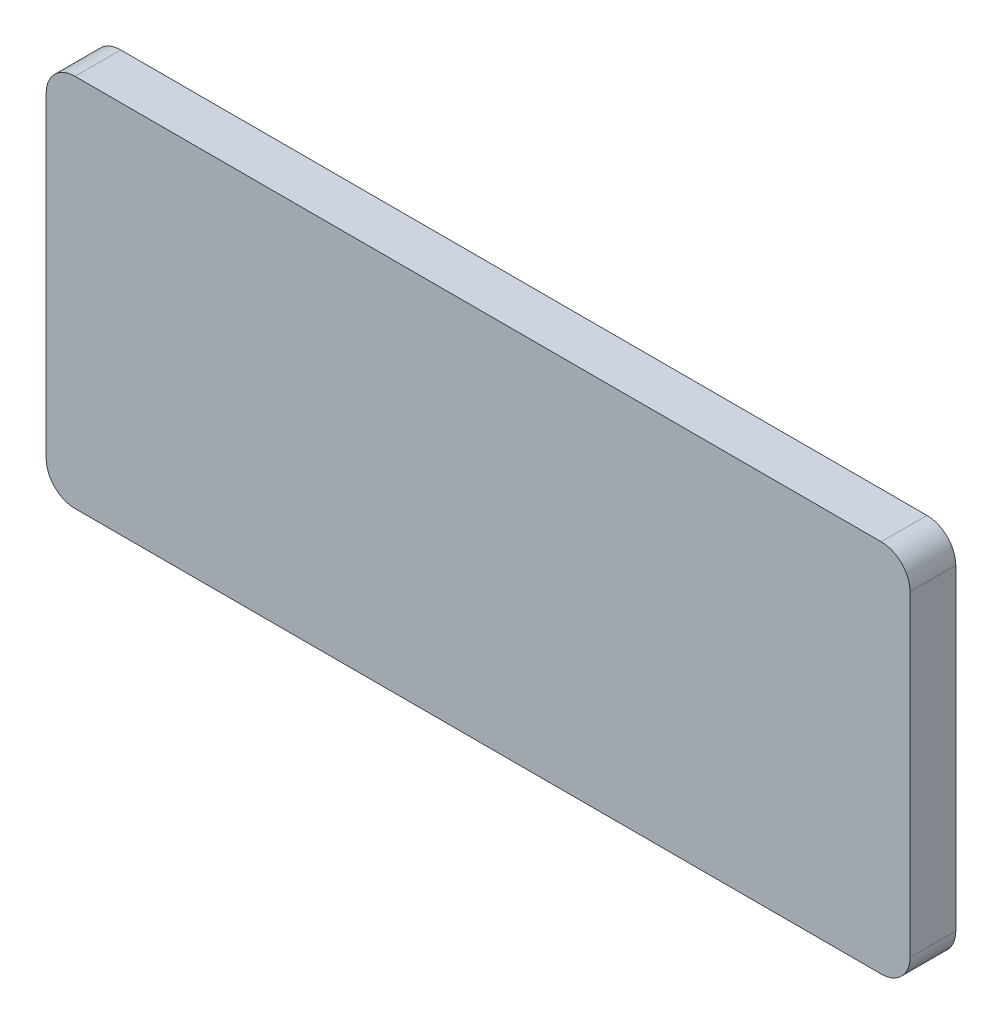
ISO-10303-21;
HEADER;
FILE_DESCRIPTION(('STEP AP214'),'2;1');
FILE_NAME('part.step','',(''),(''),'','','');
FILE_SCHEMA(('AUTOMOTIVE_DESIGN { 1 0 10303 214 1 1 1 1 }'));
ENDSEC;
DATA;
#1=APPLICATION_CONTEXT('core data for automotive mechanical design processes');
#2=APPLICATION_PROTOCOL_DEFINITION('international standard','automotive_design',2000,#1);
#3=PRODUCT_CONTEXT('',#1,'mechanical');
#4=PRODUCT('Part','Part','',(#3));
#5=PRODUCT_RELATED_PRODUCT_CATEGORY('part','',(#4));
#6=PRODUCT_DEFINITION_FORMATION('','',#4);
#7=PRODUCT_DEFINITION_CONTEXT('part definition',#1,'design');
#8=PRODUCT_DEFINITION('design','',#6,#7);
#9=PRODUCT_DEFINITION_SHAPE('','',#8);
#10=(LENGTH_UNIT() NAMED_UNIT(*) SI_UNIT(.MILLI.,.METRE.));
#11=(NAMED_UNIT(*) PLANE_ANGLE_UNIT() SI_UNIT($,.RADIAN.));
#12=(NAMED_UNIT(*) SI_UNIT($,.STERADIAN.) SOLID_ANGLE_UNIT());
#13=UNCERTAINTY_MEASURE_WITH_UNIT(LENGTH_MEASURE(1.E-05),#10,'distance_accuracy_value','');
#14=(GEOMETRIC_REPRESENTATION_CONTEXT(3) GLOBAL_UNCERTAINTY_ASSIGNED_CONTEXT((#13)) GLOBAL_UNIT_ASSIGNED_CONTEXT((#10,
#11,#12)) REPRESENTATION_CONTEXT('',''));
#15=CARTESIAN_POINT('',(0.,0.,0.));
#16=DIRECTION('',(0.,0.,1.));
#17=DIRECTION('',(1.,0.,0.));
#18=AXIS2_PLACEMENT_3D('',#15,#16,#17);
#19=CARTESIAN_POINT('',(0.,0.,3.175));
#20=DIRECTION('',(-1.,0.,0.));
#21=DIRECTION('',(0.,0.,1.));
#22=AXIS2_PLACEMENT_3D('',#19,#20,#21);
#23=PLANE('',#22);
#24=DIRECTION('',(0.,1.,0.));
#25=VECTOR('',#24,1.);
#26=CARTESIAN_POINT('',(0.,0.,0.));
#27=LINE('',#26,#25);
#28=CARTESIAN_POINT('',(0.,2.,0.));
#29=VERTEX_POINT('',#28);
#30=CARTESIAN_POINT('',(0.,24.,0.));
#31=VERTEX_POINT('',#30);
#32=EDGE_CURVE('E125',#29,#31,#27,.T.);
#33=ORIENTED_EDGE('',*,*,#32,.T.);
#34=DIRECTION('',(0.,0.,-1.));
#35=VECTOR('',#34,1.);
#36=CARTESIAN_POINT('',(0.,24.,3.175));
#37=LINE('',#36,#35);
#38=CARTESIAN_POINT('',(0.,24.,3.175));
#39=VERTEX_POINT('',#38);
#40=EDGE_CURVE('E103',#31,#39,#37,.F.);
#41=ORIENTED_EDGE('',*,*,#40,.T.);
#42=DIRECTION('',(0.,1.,0.));
#43=VECTOR('',#42,1.);
#44=CARTESIAN_POINT('',(0.,0.,3.175));
#45=LINE('',#44,#43);
#46=CARTESIAN_POINT('',(0.,2.,3.175));
#47=VERTEX_POINT('',#46);
#48=EDGE_CURVE('E134',#47,#39,#45,.T.);
#49=ORIENTED_EDGE('',*,*,#48,.F.);
#50=DIRECTION('',(0.,0.,-1.));
#51=VECTOR('',#50,1.);
#52=CARTESIAN_POINT('',(0.,2.,3.175));
#53=LINE('',#52,#51);
#54=EDGE_CURVE('E108',#47,#29,#53,.T.);
#55=ORIENTED_EDGE('',*,*,#54,.T.);
#56=EDGE_LOOP('',(#33,#41,#49,#55));
#57=FACE_BOUND('',#56,.T.);
#58=ADVANCED_FACE('F32',(#57),#23,.F.);
#59=CARTESIAN_POINT('',(0.,26.,3.175));
#60=DIRECTION('',(0.,-1.,0.));
#61=DIRECTION('',(1.,0.,0.));
#62=AXIS2_PLACEMENT_3D('',#59,#60,#61);
#63=PLANE('',#62);
#64=DIRECTION('',(-1.,0.,0.));
#65=VECTOR('',#64,1.);
#66=CARTESIAN_POINT('',(0.,26.,3.175));
#67=LINE('',#66,#65);
#68=CARTESIAN_POINT('',(-2.,26.,3.175));
#69=VERTEX_POINT('',#68);
#70=CARTESIAN_POINT('',(-58.,26.,3.175));
#71=VERTEX_POINT('',#70);
#72=EDGE_CURVE('E118',#69,#71,#67,.T.);
#73=ORIENTED_EDGE('',*,*,#72,.F.);
#74=DIRECTION('',(0.,0.,-1.));
#75=VECTOR('',#74,1.);
#76=CARTESIAN_POINT('',(-2.,26.,3.175));
#77=LINE('',#76,#75);
#78=CARTESIAN_POINT('',(-2.,26.,0.));
#79=VERTEX_POINT('',#78);
#80=EDGE_CURVE('E102',#69,#79,#77,.T.);
#81=ORIENTED_EDGE('',*,*,#80,.T.);
#82=DIRECTION('',(-1.,0.,0.));
#83=VECTOR('',#82,1.);
#84=CARTESIAN_POINT('',(0.,26.,0.));
#85=LINE('',#84,#83);
#86=CARTESIAN_POINT('',(-58.,26.,0.));
#87=VERTEX_POINT('',#86);
#88=EDGE_CURVE('E115',#79,#87,#85,.T.);
#89=ORIENTED_EDGE('',*,*,#88,.T.);
#90=DIRECTION('',(0.,0.,-1.));
#91=VECTOR('',#90,1.);
#92=CARTESIAN_POINT('',(-58.,26.,3.175));
#93=LINE('',#92,#91);
#94=EDGE_CURVE('E120',#87,#71,#93,.F.);
#95=ORIENTED_EDGE('',*,*,#94,.T.);
#96=EDGE_LOOP('',(#73,#81,#89,#95));
#97=FACE_BOUND('',#96,.T.);
#98=ADVANCED_FACE('F114',(#97),#63,.F.);
#99=CARTESIAN_POINT('',(-60.,0.,3.175));
#100=DIRECTION('',(1.,0.,0.));
#101=DIRECTION('',(0.,0.,-1.));
#102=AXIS2_PLACEMENT_3D('',#99,#100,#101);
#103=PLANE('',#102);
#104=DIRECTION('',(0.,-1.,0.));
#105=VECTOR('',#104,1.);
#106=CARTESIAN_POINT('',(-60.,0.,0.));
#107=LINE('',#106,#105);
#108=CARTESIAN_POINT('',(-60.,24.,0.));
#109=VERTEX_POINT('',#108);
#110=CARTESIAN_POINT('',(-60.,1.99999999999999,0.));
#111=VERTEX_POINT('',#110);
#112=EDGE_CURVE('E124',#109,#111,#107,.T.);
#113=ORIENTED_EDGE('',*,*,#112,.T.);
#114=DIRECTION('',(0.,0.,-1.));
#115=VECTOR('',#114,1.);
#116=CARTESIAN_POINT('',(-60.,1.99999999999999,3.175));
#117=LINE('',#116,#115);
#118=CARTESIAN_POINT('',(-60.,1.99999999999999,3.175));
#119=VERTEX_POINT('',#118);
#120=EDGE_CURVE('E11',#111,#119,#117,.F.);
#121=ORIENTED_EDGE('',*,*,#120,.T.);
#122=DIRECTION('',(0.,-1.,0.));
#123=VECTOR('',#122,1.);
#124=CARTESIAN_POINT('',(-60.,0.,3.175));
#125=LINE('',#124,#123);
#126=CARTESIAN_POINT('',(-60.,24.,3.175));
#127=VERTEX_POINT('',#126);
#128=EDGE_CURVE('E160',#127,#119,#125,.T.);
#129=ORIENTED_EDGE('',*,*,#128,.F.);
#130=DIRECTION('',(0.,0.,-1.));
#131=VECTOR('',#130,1.);
#132=CARTESIAN_POINT('',(-60.,24.,3.175));
#133=LINE('',#132,#131);
#134=EDGE_CURVE('E40',#127,#109,#133,.T.);
#135=ORIENTED_EDGE('',*,*,#134,.T.);
#136=EDGE_LOOP('',(#113,#121,#129,#135));
#137=FACE_BOUND('',#136,.T.);
#138=ADVANCED_FACE('F158',(#137),#103,.F.);
#139=CARTESIAN_POINT('',(0.,0.,3.175));
#140=DIRECTION('',(0.,1.,0.));
#141=DIRECTION('',(-1.,0.,0.));
#142=AXIS2_PLACEMENT_3D('',#139,#140,#141);
#143=PLANE('',#142);
#144=DIRECTION('',(1.,0.,0.));
#145=VECTOR('',#144,1.);
#146=CARTESIAN_POINT('',(0.,0.,0.));
#147=LINE('',#146,#145);
#148=CARTESIAN_POINT('',(-58.,0.,0.));
#149=VERTEX_POINT('',#148);
#150=CARTESIAN_POINT('',(-2.,0.,0.));
#151=VERTEX_POINT('',#150);
#152=EDGE_CURVE('E128',#149,#151,#147,.T.);
#153=ORIENTED_EDGE('',*,*,#152,.T.);
#154=DIRECTION('',(0.,0.,-1.));
#155=VECTOR('',#154,1.);
#156=CARTESIAN_POINT('',(-2.,0.,3.175));
#157=LINE('',#156,#155);
#158=CARTESIAN_POINT('',(-2.,0.,3.175));
#159=VERTEX_POINT('',#158);
#160=EDGE_CURVE('E47',#151,#159,#157,.F.);
#161=ORIENTED_EDGE('',*,*,#160,.T.);
#162=DIRECTION('',(1.,0.,0.));
#163=VECTOR('',#162,1.);
#164=CARTESIAN_POINT('',(0.,0.,3.175));
#165=LINE('',#164,#163);
#166=CARTESIAN_POINT('',(-58.,0.,3.175));
#167=VERTEX_POINT('',#166);
#168=EDGE_CURVE('E135',#167,#159,#165,.T.);
#169=ORIENTED_EDGE('',*,*,#168,.F.);
#170=DIRECTION('',(0.,0.,-1.));
#171=VECTOR('',#170,1.);
#172=CARTESIAN_POINT('',(-58.,0.,3.175));
#173=LINE('',#172,#171);
#174=EDGE_CURVE('E151',#167,#149,#173,.T.);
#175=ORIENTED_EDGE('',*,*,#174,.T.);
#176=EDGE_LOOP('',(#153,#161,#169,#175));
#177=FACE_BOUND('',#176,.T.);
#178=ADVANCED_FACE('F167',(#177),#143,.F.);
#179=CARTESIAN_POINT('',(0.,0.,3.175));
#180=DIRECTION('',(0.,0.,1.));
#181=DIRECTION('',(1.,0.,0.));
#182=AXIS2_PLACEMENT_3D('',#179,#180,#181);
#183=PLANE('',#182);
#184=ORIENTED_EDGE('',*,*,#48,.T.);
#185=CARTESIAN_POINT('',(-2.,24.,3.175));
#186=DIRECTION('',(0.,0.,1.));
#187=DIRECTION('',(1.,0.,0.));
#188=AXIS2_PLACEMENT_3D('',#185,#186,#187);
#189=CIRCLE('',#188,2.);
#190=EDGE_CURVE('E149',#39,#69,#189,.T.);
#191=ORIENTED_EDGE('',*,*,#190,.T.);
#192=ORIENTED_EDGE('',*,*,#72,.T.);
#193=CARTESIAN_POINT('',(-58.,24.,3.175));
#194=DIRECTION('',(0.,0.,1.));
#195=DIRECTION('',(1.,0.,0.));
#196=AXIS2_PLACEMENT_3D('',#193,#194,#195);
#197=CIRCLE('',#196,2.);
#198=EDGE_CURVE('E144',#71,#127,#197,.T.);
#199=ORIENTED_EDGE('',*,*,#198,.T.);
#200=ORIENTED_EDGE('',*,*,#128,.T.);
#201=CARTESIAN_POINT('',(-58.,1.99999999999999,3.175));
#202=DIRECTION('',(0.,0.,1.));
#203=DIRECTION('',(1.,0.,0.));
#204=AXIS2_PLACEMENT_3D('',#201,#202,#203);
#205=CIRCLE('',#204,2.);
#206=EDGE_CURVE('E54',#119,#167,#205,.T.);
#207=ORIENTED_EDGE('',*,*,#206,.T.);
#208=ORIENTED_EDGE('',*,*,#168,.T.);
#209=CARTESIAN_POINT('',(-2.,2.,3.175));
#210=DIRECTION('',(0.,0.,1.));
#211=DIRECTION('',(1.,0.,0.));
#212=AXIS2_PLACEMENT_3D('',#209,#210,#211);
#213=CIRCLE('',#212,2.);
#214=EDGE_CURVE('E147',#159,#47,#213,.T.);
#215=ORIENTED_EDGE('',*,*,#214,.T.);
#216=EDGE_LOOP('',(#184,#191,#192,#199,#200,#207,#208,#215));
#217=FACE_BOUND('',#216,.T.);
#218=ADVANCED_FACE('F174',(#217),#183,.T.);
#219=CARTESIAN_POINT('',(0.,0.,0.));
#220=DIRECTION('',(0.,0.,1.));
#221=DIRECTION('',(1.,0.,0.));
#222=AXIS2_PLACEMENT_3D('',#219,#220,#221);
#223=PLANE('',#222);
#224=ORIENTED_EDGE('',*,*,#88,.F.);
#225=CARTESIAN_POINT('',(-2.,24.,0.));
#226=DIRECTION('',(0.,0.,1.));
#227=DIRECTION('',(1.,0.,0.));
#228=AXIS2_PLACEMENT_3D('',#225,#226,#227);
#229=CIRCLE('',#228,2.);
#230=EDGE_CURVE('E98',#79,#31,#229,.F.);
#231=ORIENTED_EDGE('',*,*,#230,.T.);
#232=ORIENTED_EDGE('',*,*,#32,.F.);
#233=CARTESIAN_POINT('',(-2.,2.,0.));
#234=DIRECTION('',(0.,0.,1.));
#235=DIRECTION('',(1.,0.,0.));
#236=AXIS2_PLACEMENT_3D('',#233,#234,#235);
#237=CIRCLE('',#236,2.);
#238=EDGE_CURVE('E109',#29,#151,#237,.F.);
#239=ORIENTED_EDGE('',*,*,#238,.T.);
#240=ORIENTED_EDGE('',*,*,#152,.F.);
#241=CARTESIAN_POINT('',(-58.,1.99999999999999,0.));
#242=DIRECTION('',(0.,0.,1.));
#243=DIRECTION('',(1.,0.,0.));
#244=AXIS2_PLACEMENT_3D('',#241,#242,#243);
#245=CIRCLE('',#244,2.);
#246=EDGE_CURVE('E138',#149,#111,#245,.F.);
#247=ORIENTED_EDGE('',*,*,#246,.T.);
#248=ORIENTED_EDGE('',*,*,#112,.F.);
#249=CARTESIAN_POINT('',(-58.,24.,0.));
#250=DIRECTION('',(0.,0.,1.));
#251=DIRECTION('',(1.,0.,0.));
#252=AXIS2_PLACEMENT_3D('',#249,#250,#251);
#253=CIRCLE('',#252,2.);
#254=EDGE_CURVE('E119',#109,#87,#253,.F.);
#255=ORIENTED_EDGE('',*,*,#254,.T.);
#256=EDGE_LOOP('',(#224,#231,#232,#239,#240,#247,#248,#255));
#257=FACE_BOUND('',#256,.T.);
#258=ADVANCED_FACE('F122',(#257),#223,.F.);
#259=CARTESIAN_POINT('',(-2.,24.,3.175));
#260=DIRECTION('',(0.,0.,-1.));
#261=DIRECTION('',(-1.,0.,0.));
#262=AXIS2_PLACEMENT_3D('',#259,#260,#261);
#263=CYLINDRICAL_SURFACE('',#262,2.);
#264=ORIENTED_EDGE('',*,*,#190,.F.);
#265=ORIENTED_EDGE('',*,*,#40,.F.);
#266=ORIENTED_EDGE('',*,*,#230,.F.);
#267=ORIENTED_EDGE('',*,*,#80,.F.);
#268=EDGE_LOOP('',(#264,#265,#266,#267));
#269=FACE_BOUND('',#268,.T.);
#270=ADVANCED_FACE('F101',(#269),#263,.T.);
#271=CARTESIAN_POINT('',(-2.,2.,3.175));
#272=DIRECTION('',(0.,0.,-1.));
#273=DIRECTION('',(-1.,0.,0.));
#274=AXIS2_PLACEMENT_3D('',#271,#272,#273);
#275=CYLINDRICAL_SURFACE('',#274,2.);
#276=ORIENTED_EDGE('',*,*,#214,.F.);
#277=ORIENTED_EDGE('',*,*,#160,.F.);
#278=ORIENTED_EDGE('',*,*,#238,.F.);
#279=ORIENTED_EDGE('',*,*,#54,.F.);
#280=EDGE_LOOP('',(#276,#277,#278,#279));
#281=FACE_BOUND('',#280,.T.);
#282=ADVANCED_FACE('F178',(#281),#275,.T.);
#283=CARTESIAN_POINT('',(-58.,1.99999999999999,3.175));
#284=DIRECTION('',(0.,0.,-1.));
#285=DIRECTION('',(-1.,0.,0.));
#286=AXIS2_PLACEMENT_3D('',#283,#284,#285);
#287=CYLINDRICAL_SURFACE('',#286,2.);
#288=ORIENTED_EDGE('',*,*,#206,.F.);
#289=ORIENTED_EDGE('',*,*,#120,.F.);
#290=ORIENTED_EDGE('',*,*,#246,.F.);
#291=ORIENTED_EDGE('',*,*,#174,.F.);
#292=EDGE_LOOP('',(#288,#289,#290,#291));
#293=FACE_BOUND('',#292,.T.);
#294=ADVANCED_FACE('F166',(#293),#287,.T.);
#295=CARTESIAN_POINT('',(-58.,24.,3.175));
#296=DIRECTION('',(0.,0.,-1.));
#297=DIRECTION('',(-1.,0.,0.));
#298=AXIS2_PLACEMENT_3D('',#295,#296,#297);
#299=CYLINDRICAL_SURFACE('',#298,2.);
#300=ORIENTED_EDGE('',*,*,#198,.F.);
#301=ORIENTED_EDGE('',*,*,#94,.F.);
#302=ORIENTED_EDGE('',*,*,#254,.F.);
#303=ORIENTED_EDGE('',*,*,#134,.F.);
#304=EDGE_LOOP('',(#300,#301,#302,#303));
#305=FACE_BOUND('',#304,.T.);
#306=ADVANCED_FACE('F34',(#305),#299,.T.);
#307=CLOSED_SHELL('',(#58,#98,#138,#178,#218,#258,#270,#282,#294,#306));
#308=MANIFOLD_SOLID_BREP('B2',#307);
#309=ADVANCED_BREP_SHAPE_REPRESENTATION('',(#18,#308),#14);
#310=SHAPE_DEFINITION_REPRESENTATION(#9,#309);
ENDSEC;
END-ISO-10303-21;
